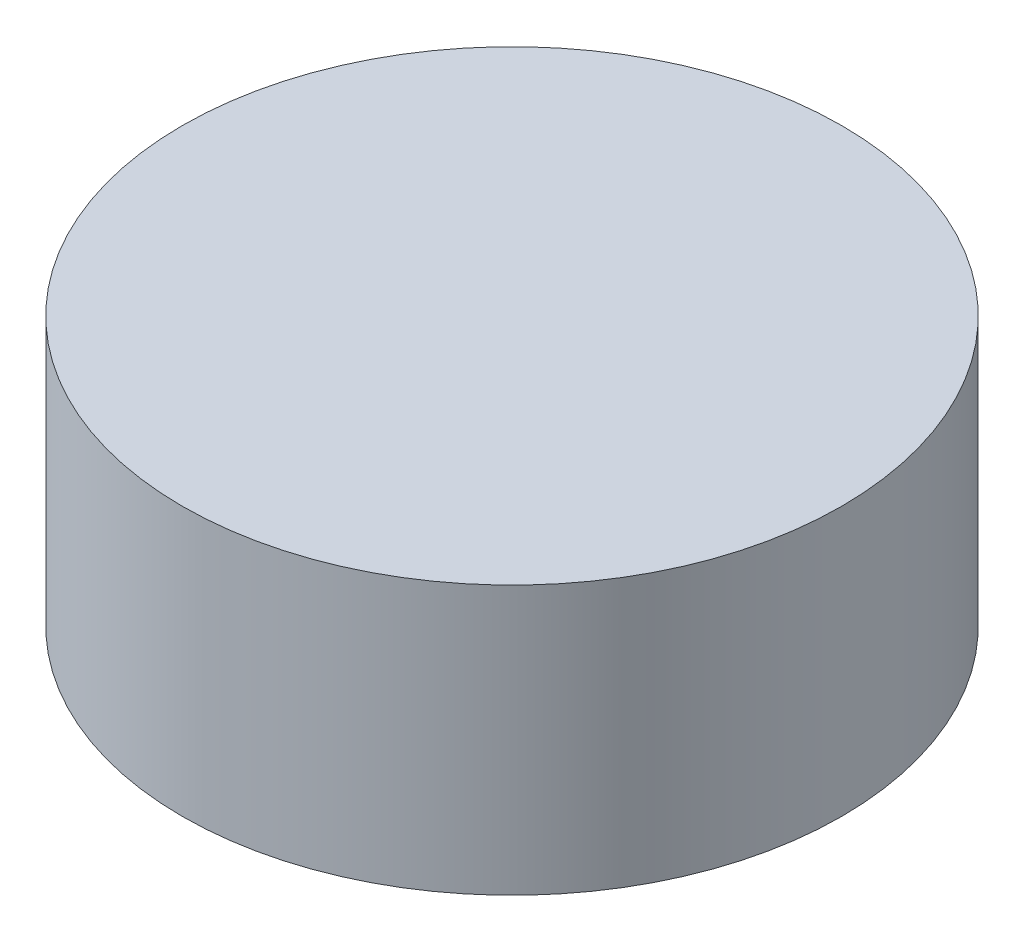
ISO-10303-21;
HEADER;
FILE_DESCRIPTION(('STEP AP214'),'2;1');
FILE_NAME('part.step','',(''),(''),'','','');
FILE_SCHEMA(('AUTOMOTIVE_DESIGN { 1 0 10303 214 1 1 1 1 }'));
ENDSEC;
DATA;
#1=APPLICATION_CONTEXT('core data for automotive mechanical design processes');
#2=APPLICATION_PROTOCOL_DEFINITION('international standard','automotive_design',2000,#1);
#3=PRODUCT_CONTEXT('',#1,'mechanical');
#4=PRODUCT('Part','Part','',(#3));
#5=PRODUCT_RELATED_PRODUCT_CATEGORY('part','',(#4));
#6=PRODUCT_DEFINITION_FORMATION('','',#4);
#7=PRODUCT_DEFINITION_CONTEXT('part definition',#1,'design');
#8=PRODUCT_DEFINITION('design','',#6,#7);
#9=PRODUCT_DEFINITION_SHAPE('','',#8);
#10=(LENGTH_UNIT() NAMED_UNIT(*) SI_UNIT(.MILLI.,.METRE.));
#11=(NAMED_UNIT(*) PLANE_ANGLE_UNIT() SI_UNIT($,.RADIAN.));
#12=(NAMED_UNIT(*) SI_UNIT($,.STERADIAN.) SOLID_ANGLE_UNIT());
#13=UNCERTAINTY_MEASURE_WITH_UNIT(LENGTH_MEASURE(1.E-05),#10,'distance_accuracy_value','');
#14=(GEOMETRIC_REPRESENTATION_CONTEXT(3) GLOBAL_UNCERTAINTY_ASSIGNED_CONTEXT((#13)) GLOBAL_UNIT_ASSIGNED_CONTEXT((#10,
#11,#12)) REPRESENTATION_CONTEXT('',''));
#15=CARTESIAN_POINT('',(0.,0.,0.));
#16=DIRECTION('',(0.,0.,1.));
#17=DIRECTION('',(1.,0.,0.));
#18=AXIS2_PLACEMENT_3D('',#15,#16,#17);
#19=CARTESIAN_POINT('',(61.8643222732027,33.,11.0479338377505));
#20=DIRECTION('',(0.,1.,0.));
#21=DIRECTION('',(0.,0.,1.));
#22=AXIS2_PLACEMENT_3D('',#19,#20,#21);
#23=PLANE('',#22);
#24=CARTESIAN_POINT('',(98.6853222732027,33.,47.8689338377506));
#25=DIRECTION('',(0.,-1.,0.));
#26=DIRECTION('',(0.,0.,-1.));
#27=AXIS2_PLACEMENT_3D('',#24,#25,#26);
#28=CIRCLE('',#27,36.8200000000002);
#29=CARTESIAN_POINT('',(98.6853222732027,33.,11.0489338377504));
#30=VERTEX_POINT('',#29);
#31=EDGE_CURVE('E18',#30,#30,#28,.T.);
#32=ORIENTED_EDGE('',*,*,#31,.F.);
#33=EDGE_LOOP('',(#32));
#34=FACE_BOUND('',#33,.T.);
#35=ADVANCED_FACE('F14',(#34),#23,.T.);
#36=CARTESIAN_POINT('',(61.8643222732027,3.,84.6899338377505));
#37=DIRECTION('',(0.,-1.,0.));
#38=DIRECTION('',(0.,0.,-1.));
#39=AXIS2_PLACEMENT_3D('',#36,#37,#38);
#40=PLANE('',#39);
#41=CARTESIAN_POINT('',(98.6853222732027,3.,47.8689338377506));
#42=DIRECTION('',(0.,-1.,0.));
#43=DIRECTION('',(0.,0.,-1.));
#44=AXIS2_PLACEMENT_3D('',#41,#42,#43);
#45=CIRCLE('',#44,36.8200000000002);
#46=CARTESIAN_POINT('',(98.6853222732027,3.,11.0489338377504));
#47=VERTEX_POINT('',#46);
#48=EDGE_CURVE('E10',#47,#47,#45,.F.);
#49=ORIENTED_EDGE('',*,*,#48,.F.);
#50=EDGE_LOOP('',(#49));
#51=FACE_BOUND('',#50,.T.);
#52=ADVANCED_FACE('F32',(#51),#40,.T.);
#53=CARTESIAN_POINT('',(98.6853222732027,33.,47.8689338377506));
#54=DIRECTION('',(0.,-1.,0.));
#55=DIRECTION('',(0.,0.,-1.));
#56=AXIS2_PLACEMENT_3D('',#53,#54,#55);
#57=CYLINDRICAL_SURFACE('',#56,36.8200000000002);
#58=ORIENTED_EDGE('',*,*,#48,.T.);
#59=EDGE_LOOP('',(#58));
#60=FACE_BOUND('',#59,.T.);
#61=ORIENTED_EDGE('',*,*,#31,.T.);
#62=EDGE_LOOP('',(#61));
#63=FACE_BOUND('',#62,.T.);
#64=ADVANCED_FACE('F16',(#60,#63),#57,.T.);
#65=CLOSED_SHELL('',(#35,#52,#64));
#66=MANIFOLD_SOLID_BREP('B1',#65);
#67=ADVANCED_BREP_SHAPE_REPRESENTATION('',(#18,#66),#14);
#68=SHAPE_DEFINITION_REPRESENTATION(#9,#67);
ENDSEC;
END-ISO-10303-21;
